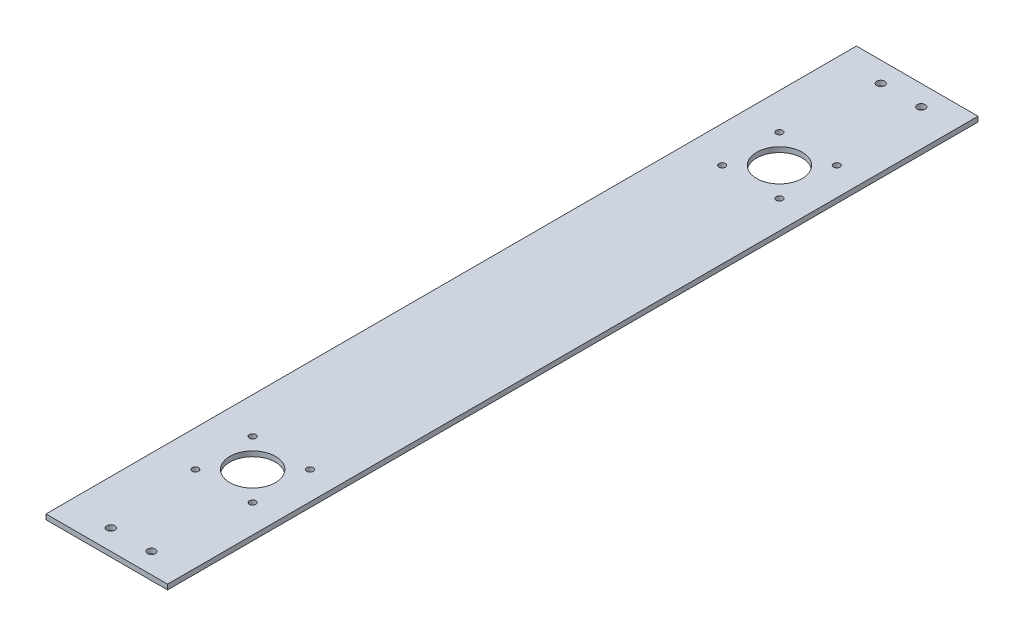
ISO-10303-21;
HEADER;
FILE_DESCRIPTION(('STEP AP214'),'2;1');
FILE_NAME('part.step','',(''),(''),'','','');
FILE_SCHEMA(('AUTOMOTIVE_DESIGN { 1 0 10303 214 1 1 1 1 }'));
ENDSEC;
DATA;
#1=APPLICATION_CONTEXT('core data for automotive mechanical design processes');
#2=APPLICATION_PROTOCOL_DEFINITION('international standard','automotive_design',2000,#1);
#3=PRODUCT_CONTEXT('',#1,'mechanical');
#4=PRODUCT('Part','Part','',(#3));
#5=PRODUCT_RELATED_PRODUCT_CATEGORY('part','',(#4));
#6=PRODUCT_DEFINITION_FORMATION('','',#4);
#7=PRODUCT_DEFINITION_CONTEXT('part definition',#1,'design');
#8=PRODUCT_DEFINITION('design','',#6,#7);
#9=PRODUCT_DEFINITION_SHAPE('','',#8);
#10=(LENGTH_UNIT() NAMED_UNIT(*) SI_UNIT(.MILLI.,.METRE.));
#11=(NAMED_UNIT(*) PLANE_ANGLE_UNIT() SI_UNIT($,.RADIAN.));
#12=(NAMED_UNIT(*) SI_UNIT($,.STERADIAN.) SOLID_ANGLE_UNIT());
#13=UNCERTAINTY_MEASURE_WITH_UNIT(LENGTH_MEASURE(1.E-05),#10,'distance_accuracy_value','');
#14=(GEOMETRIC_REPRESENTATION_CONTEXT(3) GLOBAL_UNCERTAINTY_ASSIGNED_CONTEXT((#13)) GLOBAL_UNIT_ASSIGNED_CONTEXT((#10,
#11,#12)) REPRESENTATION_CONTEXT('',''));
#15=CARTESIAN_POINT('',(0.,0.,0.));
#16=DIRECTION('',(0.,0.,1.));
#17=DIRECTION('',(1.,0.,0.));
#18=AXIS2_PLACEMENT_3D('',#15,#16,#17);
#19=CARTESIAN_POINT('',(0.,3.175,0.));
#20=DIRECTION('',(0.,0.,-1.));
#21=DIRECTION('',(-1.,0.,0.));
#22=AXIS2_PLACEMENT_3D('',#19,#20,#21);
#23=PLANE('',#22);
#24=DIRECTION('',(1.,0.,0.));
#25=VECTOR('',#24,1.);
#26=CARTESIAN_POINT('',(0.,3.175,0.));
#27=LINE('',#26,#25);
#28=CARTESIAN_POINT('',(124.46,3.175,0.));
#29=VERTEX_POINT('',#28);
#30=CARTESIAN_POINT('',(200.66,3.175,0.));
#31=VERTEX_POINT('',#30);
#32=EDGE_CURVE('E41',#29,#31,#27,.T.);
#33=ORIENTED_EDGE('',*,*,#32,.F.);
#34=DIRECTION('',(0.,1.,0.));
#35=VECTOR('',#34,1.);
#36=CARTESIAN_POINT('',(124.46,-0.00100000000000013,0.));
#37=LINE('',#36,#35);
#38=CARTESIAN_POINT('',(124.46,0.,0.));
#39=VERTEX_POINT('',#38);
#40=EDGE_CURVE('E73',#39,#29,#37,.T.);
#41=ORIENTED_EDGE('',*,*,#40,.F.);
#42=DIRECTION('',(1.,0.,0.));
#43=VECTOR('',#42,1.);
#44=CARTESIAN_POINT('',(0.,0.,0.));
#45=LINE('',#44,#43);
#46=CARTESIAN_POINT('',(200.66,0.,0.));
#47=VERTEX_POINT('',#46);
#48=EDGE_CURVE('E91',#39,#47,#45,.T.);
#49=ORIENTED_EDGE('',*,*,#48,.T.);
#50=DIRECTION('',(0.,1.,0.));
#51=VECTOR('',#50,1.);
#52=CARTESIAN_POINT('',(200.66,-0.00100000000000013,0.));
#53=LINE('',#52,#51);
#54=EDGE_CURVE('E49',#47,#31,#53,.T.);
#55=ORIENTED_EDGE('',*,*,#54,.T.);
#56=EDGE_LOOP('',(#33,#41,#49,#55));
#57=FACE_BOUND('',#56,.T.);
#58=ADVANCED_FACE('F33',(#57),#23,.F.);
#59=CARTESIAN_POINT('',(0.,3.175,-508.));
#60=DIRECTION('',(0.,0.,1.));
#61=DIRECTION('',(1.,0.,0.));
#62=AXIS2_PLACEMENT_3D('',#59,#60,#61);
#63=PLANE('',#62);
#64=DIRECTION('',(-1.,0.,0.));
#65=VECTOR('',#64,1.);
#66=CARTESIAN_POINT('',(0.,0.,-508.));
#67=LINE('',#66,#65);
#68=CARTESIAN_POINT('',(200.66,0.,-508.));
#69=VERTEX_POINT('',#68);
#70=CARTESIAN_POINT('',(124.46,0.,-508.));
#71=VERTEX_POINT('',#70);
#72=EDGE_CURVE('E36',#69,#71,#67,.T.);
#73=ORIENTED_EDGE('',*,*,#72,.T.);
#74=DIRECTION('',(0.,1.,0.));
#75=VECTOR('',#74,1.);
#76=CARTESIAN_POINT('',(124.46,-0.00100000000000013,-508.));
#77=LINE('',#76,#75);
#78=CARTESIAN_POINT('',(124.46,3.175,-508.));
#79=VERTEX_POINT('',#78);
#80=EDGE_CURVE('E57',#71,#79,#77,.T.);
#81=ORIENTED_EDGE('',*,*,#80,.T.);
#82=DIRECTION('',(-1.,0.,0.));
#83=VECTOR('',#82,1.);
#84=CARTESIAN_POINT('',(0.,3.175,-508.));
#85=LINE('',#84,#83);
#86=CARTESIAN_POINT('',(200.66,3.175,-508.));
#87=VERTEX_POINT('',#86);
#88=EDGE_CURVE('E11',#87,#79,#85,.T.);
#89=ORIENTED_EDGE('',*,*,#88,.F.);
#90=DIRECTION('',(0.,1.,0.));
#91=VECTOR('',#90,1.);
#92=CARTESIAN_POINT('',(200.66,-0.00100000000000013,-508.));
#93=LINE('',#92,#91);
#94=EDGE_CURVE('E179',#69,#87,#93,.T.);
#95=ORIENTED_EDGE('',*,*,#94,.F.);
#96=EDGE_LOOP('',(#73,#81,#89,#95));
#97=FACE_BOUND('',#96,.T.);
#98=ADVANCED_FACE('F193',(#97),#63,.F.);
#99=CARTESIAN_POINT('',(0.,3.175,0.));
#100=DIRECTION('',(0.,-1.,0.));
#101=DIRECTION('',(0.,0.,-1.));
#102=AXIS2_PLACEMENT_3D('',#99,#100,#101);
#103=PLANE('',#102);
#104=CARTESIAN_POINT('',(147.139487788,3.175,-401.139487788));
#105=DIRECTION('',(0.,-1.,0.));
#106=DIRECTION('',(0.,0.,-1.));
#107=AXIS2_PLACEMENT_3D('',#104,#105,#106);
#108=CIRCLE('',#107,2.0193);
#109=CARTESIAN_POINT('',(147.139487788,3.175,-403.158787788));
#110=VERTEX_POINT('',#109);
#111=EDGE_CURVE('E129',#110,#110,#108,.T.);
#112=ORIENTED_EDGE('',*,*,#111,.T.);
#113=EDGE_LOOP('',(#112));
#114=FACE_BOUND('',#113,.T.);
#115=CARTESIAN_POINT('',(147.139487788,3.175,-106.860512212));
#116=DIRECTION('',(0.,-1.,0.));
#117=DIRECTION('',(0.,0.,-1.));
#118=AXIS2_PLACEMENT_3D('',#115,#116,#117);
#119=CIRCLE('',#118,2.0193);
#120=CARTESIAN_POINT('',(147.139487788,3.175,-108.879812212));
#121=VERTEX_POINT('',#120);
#122=EDGE_CURVE('E134',#121,#121,#119,.T.);
#123=ORIENTED_EDGE('',*,*,#122,.T.);
#124=EDGE_LOOP('',(#123));
#125=FACE_BOUND('',#124,.T.);
#126=CARTESIAN_POINT('',(183.060512212,3.175,-106.860512212));
#127=DIRECTION('',(0.,-1.,0.));
#128=DIRECTION('',(0.,0.,-1.));
#129=AXIS2_PLACEMENT_3D('',#126,#127,#128);
#130=CIRCLE('',#129,2.0193);
#131=CARTESIAN_POINT('',(183.060512212,3.175,-108.879812212));
#132=VERTEX_POINT('',#131);
#133=EDGE_CURVE('E137',#132,#132,#130,.T.);
#134=ORIENTED_EDGE('',*,*,#133,.T.);
#135=EDGE_LOOP('',(#134));
#136=FACE_BOUND('',#135,.T.);
#137=CARTESIAN_POINT('',(183.060512212,3.175,-70.939487788));
#138=DIRECTION('',(0.,-1.,0.));
#139=DIRECTION('',(0.,0.,-1.));
#140=AXIS2_PLACEMENT_3D('',#137,#138,#139);
#141=CIRCLE('',#140,2.0193);
#142=CARTESIAN_POINT('',(183.060512212,3.175,-72.958787788));
#143=VERTEX_POINT('',#142);
#144=EDGE_CURVE('E140',#143,#143,#141,.T.);
#145=ORIENTED_EDGE('',*,*,#144,.T.);
#146=EDGE_LOOP('',(#145));
#147=FACE_BOUND('',#146,.T.);
#148=CARTESIAN_POINT('',(147.139487788,3.175,-70.939487788));
#149=DIRECTION('',(0.,-1.,0.));
#150=DIRECTION('',(0.,0.,-1.));
#151=AXIS2_PLACEMENT_3D('',#148,#149,#150);
#152=CIRCLE('',#151,2.0193);
#153=CARTESIAN_POINT('',(147.139487788,3.175,-72.958787788));
#154=VERTEX_POINT('',#153);
#155=EDGE_CURVE('E143',#154,#154,#152,.T.);
#156=ORIENTED_EDGE('',*,*,#155,.T.);
#157=EDGE_LOOP('',(#156));
#158=FACE_BOUND('',#157,.T.);
#159=CARTESIAN_POINT('',(147.139487788,3.175,-437.060512212));
#160=DIRECTION('',(0.,-1.,0.));
#161=DIRECTION('',(0.,0.,-1.));
#162=AXIS2_PLACEMENT_3D('',#159,#160,#161);
#163=CIRCLE('',#162,2.0193);
#164=CARTESIAN_POINT('',(147.139487788,3.175,-439.079812212));
#165=VERTEX_POINT('',#164);
#166=EDGE_CURVE('E146',#165,#165,#163,.T.);
#167=ORIENTED_EDGE('',*,*,#166,.T.);
#168=EDGE_LOOP('',(#167));
#169=FACE_BOUND('',#168,.T.);
#170=CARTESIAN_POINT('',(183.060512212,3.175,-437.060512212));
#171=DIRECTION('',(0.,-1.,0.));
#172=DIRECTION('',(0.,0.,-1.));
#173=AXIS2_PLACEMENT_3D('',#170,#171,#172);
#174=CIRCLE('',#173,2.0193);
#175=CARTESIAN_POINT('',(183.060512212,3.175,-439.079812212));
#176=VERTEX_POINT('',#175);
#177=EDGE_CURVE('E149',#176,#176,#174,.T.);
#178=ORIENTED_EDGE('',*,*,#177,.T.);
#179=EDGE_LOOP('',(#178));
#180=FACE_BOUND('',#179,.T.);
#181=CARTESIAN_POINT('',(183.060512212,3.175,-401.139487788));
#182=DIRECTION('',(0.,-1.,0.));
#183=DIRECTION('',(0.,0.,-1.));
#184=AXIS2_PLACEMENT_3D('',#181,#182,#183);
#185=CIRCLE('',#184,2.0193);
#186=CARTESIAN_POINT('',(183.060512212,3.175,-403.158787788));
#187=VERTEX_POINT('',#186);
#188=EDGE_CURVE('E152',#187,#187,#185,.T.);
#189=ORIENTED_EDGE('',*,*,#188,.T.);
#190=EDGE_LOOP('',(#189));
#191=FACE_BOUND('',#190,.T.);
#192=CARTESIAN_POINT('',(177.8,3.175,-12.7));
#193=DIRECTION('',(0.,-1.,0.));
#194=DIRECTION('',(0.,0.,-1.));
#195=AXIS2_PLACEMENT_3D('',#192,#193,#194);
#196=CIRCLE('',#195,2.4892);
#197=CARTESIAN_POINT('',(177.8,3.175,-15.1892));
#198=VERTEX_POINT('',#197);
#199=EDGE_CURVE('E105',#198,#198,#196,.T.);
#200=ORIENTED_EDGE('',*,*,#199,.T.);
#201=EDGE_LOOP('',(#200));
#202=FACE_BOUND('',#201,.T.);
#203=CARTESIAN_POINT('',(152.4,3.175,-12.7));
#204=DIRECTION('',(0.,-1.,0.));
#205=DIRECTION('',(0.,0.,-1.));
#206=AXIS2_PLACEMENT_3D('',#203,#204,#205);
#207=CIRCLE('',#206,2.4892);
#208=CARTESIAN_POINT('',(152.4,3.175,-15.1892));
#209=VERTEX_POINT('',#208);
#210=EDGE_CURVE('E110',#209,#209,#207,.T.);
#211=ORIENTED_EDGE('',*,*,#210,.T.);
#212=EDGE_LOOP('',(#211));
#213=FACE_BOUND('',#212,.T.);
#214=CARTESIAN_POINT('',(177.8,3.175,-495.3));
#215=DIRECTION('',(0.,-1.,0.));
#216=DIRECTION('',(0.,0.,-1.));
#217=AXIS2_PLACEMENT_3D('',#214,#215,#216);
#218=CIRCLE('',#217,2.48920000000001);
#219=CARTESIAN_POINT('',(177.8,3.175,-497.7892));
#220=VERTEX_POINT('',#219);
#221=EDGE_CURVE('E113',#220,#220,#218,.T.);
#222=ORIENTED_EDGE('',*,*,#221,.T.);
#223=EDGE_LOOP('',(#222));
#224=FACE_BOUND('',#223,.T.);
#225=CARTESIAN_POINT('',(152.4,3.175,-495.3));
#226=DIRECTION('',(0.,-1.,0.));
#227=DIRECTION('',(0.,0.,-1.));
#228=AXIS2_PLACEMENT_3D('',#225,#226,#227);
#229=CIRCLE('',#228,2.48920000000001);
#230=CARTESIAN_POINT('',(152.4,3.175,-497.7892));
#231=VERTEX_POINT('',#230);
#232=EDGE_CURVE('E116',#231,#231,#229,.T.);
#233=ORIENTED_EDGE('',*,*,#232,.T.);
#234=EDGE_LOOP('',(#233));
#235=FACE_BOUND('',#234,.T.);
#236=CARTESIAN_POINT('',(165.1,3.175,-419.1));
#237=DIRECTION('',(0.,1.,0.));
#238=DIRECTION('',(0.,0.,1.));
#239=AXIS2_PLACEMENT_3D('',#236,#237,#238);
#240=CIRCLE('',#239,14.2875);
#241=CARTESIAN_POINT('',(165.1,3.175,-404.8125));
#242=VERTEX_POINT('',#241);
#243=EDGE_CURVE('E93',#242,#242,#240,.T.);
#244=ORIENTED_EDGE('',*,*,#243,.F.);
#245=EDGE_LOOP('',(#244));
#246=FACE_BOUND('',#245,.T.);
#247=CARTESIAN_POINT('',(165.1,3.175,-88.9));
#248=DIRECTION('',(0.,1.,0.));
#249=DIRECTION('',(0.,0.,1.));
#250=AXIS2_PLACEMENT_3D('',#247,#248,#249);
#251=CIRCLE('',#250,14.2875);
#252=CARTESIAN_POINT('',(165.1,3.175,-74.6125));
#253=VERTEX_POINT('',#252);
#254=EDGE_CURVE('E102',#253,#253,#251,.T.);
#255=ORIENTED_EDGE('',*,*,#254,.F.);
#256=EDGE_LOOP('',(#255));
#257=FACE_BOUND('',#256,.T.);
#258=ORIENTED_EDGE('',*,*,#88,.T.);
#259=DIRECTION('',(0.,0.,-1.));
#260=VECTOR('',#259,1.);
#261=CARTESIAN_POINT('',(124.46,3.175,-508.));
#262=LINE('',#261,#260);
#263=EDGE_CURVE('E76',#29,#79,#262,.T.);
#264=ORIENTED_EDGE('',*,*,#263,.F.);
#265=ORIENTED_EDGE('',*,*,#32,.T.);
#266=DIRECTION('',(0.,0.,1.));
#267=VECTOR('',#266,1.);
#268=CARTESIAN_POINT('',(200.66,3.175,-508.));
#269=LINE('',#268,#267);
#270=EDGE_CURVE('E181',#87,#31,#269,.T.);
#271=ORIENTED_EDGE('',*,*,#270,.F.);
#272=EDGE_LOOP('',(#258,#264,#265,#271));
#273=FACE_BOUND('',#272,.T.);
#274=ADVANCED_FACE('F85',(#114,#125,#136,#147,#158,#169,#180,#191,#202,#213,#224,#235,#246,#257,
#273),#103,.F.);
#275=CARTESIAN_POINT('',(0.,0.,0.));
#276=DIRECTION('',(0.,-1.,0.));
#277=DIRECTION('',(0.,0.,-1.));
#278=AXIS2_PLACEMENT_3D('',#275,#276,#277);
#279=PLANE('',#278);
#280=DIRECTION('',(0.,0.,-1.));
#281=VECTOR('',#280,1.);
#282=CARTESIAN_POINT('',(124.46,0.,-508.));
#283=LINE('',#282,#281);
#284=EDGE_CURVE('E77',#39,#71,#283,.T.);
#285=ORIENTED_EDGE('',*,*,#284,.T.);
#286=ORIENTED_EDGE('',*,*,#72,.F.);
#287=DIRECTION('',(0.,0.,1.));
#288=VECTOR('',#287,1.);
#289=CARTESIAN_POINT('',(200.66,0.,-508.));
#290=LINE('',#289,#288);
#291=EDGE_CURVE('E184',#69,#47,#290,.T.);
#292=ORIENTED_EDGE('',*,*,#291,.T.);
#293=ORIENTED_EDGE('',*,*,#48,.F.);
#294=EDGE_LOOP('',(#285,#286,#292,#293));
#295=FACE_BOUND('',#294,.T.);
#296=CARTESIAN_POINT('',(147.139487788,0.,-401.139487788));
#297=DIRECTION('',(0.,1.,0.));
#298=DIRECTION('',(0.,0.,1.));
#299=AXIS2_PLACEMENT_3D('',#296,#297,#298);
#300=CIRCLE('',#299,2.0193);
#301=CARTESIAN_POINT('',(147.139487788,0.,-399.120187788));
#302=VERTEX_POINT('',#301);
#303=EDGE_CURVE('E160',#302,#302,#300,.T.);
#304=ORIENTED_EDGE('',*,*,#303,.T.);
#305=EDGE_LOOP('',(#304));
#306=FACE_BOUND('',#305,.T.);
#307=CARTESIAN_POINT('',(147.139487788,0.,-106.860512212));
#308=DIRECTION('',(0.,1.,0.));
#309=DIRECTION('',(0.,0.,-1.));
#310=AXIS2_PLACEMENT_3D('',#307,#308,#309);
#311=CIRCLE('',#310,2.0193);
#312=CARTESIAN_POINT('',(147.139487788,0.,-108.879812212));
#313=VERTEX_POINT('',#312);
#314=EDGE_CURVE('E172',#313,#313,#311,.T.);
#315=ORIENTED_EDGE('',*,*,#314,.T.);
#316=EDGE_LOOP('',(#315));
#317=FACE_BOUND('',#316,.T.);
#318=CARTESIAN_POINT('',(183.060512212,0.,-106.860512212));
#319=DIRECTION('',(0.,1.,0.));
#320=DIRECTION('',(0.,0.,-1.));
#321=AXIS2_PLACEMENT_3D('',#318,#319,#320);
#322=CIRCLE('',#321,2.0193);
#323=CARTESIAN_POINT('',(183.060512212,0.,-108.879812212));
#324=VERTEX_POINT('',#323);
#325=EDGE_CURVE('E168',#324,#324,#322,.T.);
#326=ORIENTED_EDGE('',*,*,#325,.T.);
#327=EDGE_LOOP('',(#326));
#328=FACE_BOUND('',#327,.T.);
#329=CARTESIAN_POINT('',(183.060512212,0.,-70.939487788));
#330=DIRECTION('',(0.,1.,0.));
#331=DIRECTION('',(0.,0.,-1.));
#332=AXIS2_PLACEMENT_3D('',#329,#330,#331);
#333=CIRCLE('',#332,2.0193);
#334=CARTESIAN_POINT('',(183.060512212,0.,-72.958787788));
#335=VERTEX_POINT('',#334);
#336=EDGE_CURVE('E165',#335,#335,#333,.T.);
#337=ORIENTED_EDGE('',*,*,#336,.T.);
#338=EDGE_LOOP('',(#337));
#339=FACE_BOUND('',#338,.T.);
#340=CARTESIAN_POINT('',(147.139487788,0.,-70.939487788));
#341=DIRECTION('',(0.,1.,0.));
#342=DIRECTION('',(0.,0.,-1.));
#343=AXIS2_PLACEMENT_3D('',#340,#341,#342);
#344=CIRCLE('',#343,2.0193);
#345=CARTESIAN_POINT('',(147.139487788,0.,-72.958787788));
#346=VERTEX_POINT('',#345);
#347=EDGE_CURVE('E169',#346,#346,#344,.T.);
#348=ORIENTED_EDGE('',*,*,#347,.T.);
#349=EDGE_LOOP('',(#348));
#350=FACE_BOUND('',#349,.T.);
#351=CARTESIAN_POINT('',(147.139487788,0.,-437.060512212));
#352=DIRECTION('',(0.,1.,0.));
#353=DIRECTION('',(0.,0.,1.));
#354=AXIS2_PLACEMENT_3D('',#351,#352,#353);
#355=CIRCLE('',#354,2.0193);
#356=CARTESIAN_POINT('',(147.139487788,0.,-435.041212212));
#357=VERTEX_POINT('',#356);
#358=EDGE_CURVE('E155',#357,#357,#355,.T.);
#359=ORIENTED_EDGE('',*,*,#358,.T.);
#360=EDGE_LOOP('',(#359));
#361=FACE_BOUND('',#360,.T.);
#362=CARTESIAN_POINT('',(183.060512212,0.,-437.060512212));
#363=DIRECTION('',(0.,1.,0.));
#364=DIRECTION('',(0.,0.,1.));
#365=AXIS2_PLACEMENT_3D('',#362,#363,#364);
#366=CIRCLE('',#365,2.0193);
#367=CARTESIAN_POINT('',(183.060512212,0.,-435.041212212));
#368=VERTEX_POINT('',#367);
#369=EDGE_CURVE('E159',#368,#368,#366,.T.);
#370=ORIENTED_EDGE('',*,*,#369,.T.);
#371=EDGE_LOOP('',(#370));
#372=FACE_BOUND('',#371,.T.);
#373=CARTESIAN_POINT('',(183.060512212,0.,-401.139487788));
#374=DIRECTION('',(0.,1.,0.));
#375=DIRECTION('',(0.,0.,1.));
#376=AXIS2_PLACEMENT_3D('',#373,#374,#375);
#377=CIRCLE('',#376,2.0193);
#378=CARTESIAN_POINT('',(183.060512212,0.,-399.120187788));
#379=VERTEX_POINT('',#378);
#380=EDGE_CURVE('E156',#379,#379,#377,.T.);
#381=ORIENTED_EDGE('',*,*,#380,.T.);
#382=EDGE_LOOP('',(#381));
#383=FACE_BOUND('',#382,.T.);
#384=CARTESIAN_POINT('',(177.8,0.,-12.7));
#385=DIRECTION('',(0.,1.,0.));
#386=DIRECTION('',(0.,0.,1.));
#387=AXIS2_PLACEMENT_3D('',#384,#385,#386);
#388=CIRCLE('',#387,2.4892);
#389=CARTESIAN_POINT('',(177.8,0.,-10.2108));
#390=VERTEX_POINT('',#389);
#391=EDGE_CURVE('E120',#390,#390,#388,.T.);
#392=ORIENTED_EDGE('',*,*,#391,.T.);
#393=EDGE_LOOP('',(#392));
#394=FACE_BOUND('',#393,.T.);
#395=CARTESIAN_POINT('',(152.4,0.,-12.7));
#396=DIRECTION('',(0.,1.,0.));
#397=DIRECTION('',(0.,0.,1.));
#398=AXIS2_PLACEMENT_3D('',#395,#396,#397);
#399=CIRCLE('',#398,2.4892);
#400=CARTESIAN_POINT('',(152.4,0.,-10.2108));
#401=VERTEX_POINT('',#400);
#402=EDGE_CURVE('E119',#401,#401,#399,.T.);
#403=ORIENTED_EDGE('',*,*,#402,.T.);
#404=EDGE_LOOP('',(#403));
#405=FACE_BOUND('',#404,.T.);
#406=CARTESIAN_POINT('',(177.8,0.,-495.3));
#407=DIRECTION('',(0.,1.,0.));
#408=DIRECTION('',(0.,0.,-1.));
#409=AXIS2_PLACEMENT_3D('',#406,#407,#408);
#410=CIRCLE('',#409,2.48920000000001);
#411=CARTESIAN_POINT('',(177.8,0.,-497.7892));
#412=VERTEX_POINT('',#411);
#413=EDGE_CURVE('E123',#412,#412,#410,.T.);
#414=ORIENTED_EDGE('',*,*,#413,.T.);
#415=EDGE_LOOP('',(#414));
#416=FACE_BOUND('',#415,.T.);
#417=CARTESIAN_POINT('',(152.4,0.,-495.3));
#418=DIRECTION('',(0.,1.,0.));
#419=DIRECTION('',(0.,0.,-1.));
#420=AXIS2_PLACEMENT_3D('',#417,#418,#419);
#421=CIRCLE('',#420,2.48920000000001);
#422=CARTESIAN_POINT('',(152.4,0.,-497.7892));
#423=VERTEX_POINT('',#422);
#424=EDGE_CURVE('E126',#423,#423,#421,.T.);
#425=ORIENTED_EDGE('',*,*,#424,.T.);
#426=EDGE_LOOP('',(#425));
#427=FACE_BOUND('',#426,.T.);
#428=CARTESIAN_POINT('',(165.1,0.,-419.1));
#429=DIRECTION('',(0.,1.,0.));
#430=DIRECTION('',(0.,0.,1.));
#431=AXIS2_PLACEMENT_3D('',#428,#429,#430);
#432=CIRCLE('',#431,14.2875);
#433=CARTESIAN_POINT('',(165.1,0.,-404.8125));
#434=VERTEX_POINT('',#433);
#435=EDGE_CURVE('E95',#434,#434,#432,.T.);
#436=ORIENTED_EDGE('',*,*,#435,.T.);
#437=EDGE_LOOP('',(#436));
#438=FACE_BOUND('',#437,.T.);
#439=CARTESIAN_POINT('',(165.1,0.,-88.9));
#440=DIRECTION('',(0.,1.,0.));
#441=DIRECTION('',(0.,0.,1.));
#442=AXIS2_PLACEMENT_3D('',#439,#440,#441);
#443=CIRCLE('',#442,14.2875);
#444=CARTESIAN_POINT('',(165.1,0.,-74.6125));
#445=VERTEX_POINT('',#444);
#446=EDGE_CURVE('E100',#445,#445,#443,.T.);
#447=ORIENTED_EDGE('',*,*,#446,.T.);
#448=EDGE_LOOP('',(#447));
#449=FACE_BOUND('',#448,.T.);
#450=ADVANCED_FACE('F189',(#295,#306,#317,#328,#339,#350,#361,#372,#383,#394,#405,#416,#427,
#438,#449),#279,.T.);
#451=CARTESIAN_POINT('',(165.1,0.,-88.9));
#452=DIRECTION('',(0.,1.,0.));
#453=DIRECTION('',(0.,0.,1.));
#454=AXIS2_PLACEMENT_3D('',#451,#452,#453);
#455=CYLINDRICAL_SURFACE('',#454,14.2875);
#456=ORIENTED_EDGE('',*,*,#446,.F.);
#457=EDGE_LOOP('',(#456));
#458=FACE_BOUND('',#457,.T.);
#459=ORIENTED_EDGE('',*,*,#254,.T.);
#460=EDGE_LOOP('',(#459));
#461=FACE_BOUND('',#460,.T.);
#462=ADVANCED_FACE('F219',(#458,#461),#455,.F.);
#463=CARTESIAN_POINT('',(165.1,0.,-419.1));
#464=DIRECTION('',(0.,1.,0.));
#465=DIRECTION('',(0.,0.,1.));
#466=AXIS2_PLACEMENT_3D('',#463,#464,#465);
#467=CYLINDRICAL_SURFACE('',#466,14.2875);
#468=ORIENTED_EDGE('',*,*,#435,.F.);
#469=EDGE_LOOP('',(#468));
#470=FACE_BOUND('',#469,.T.);
#471=ORIENTED_EDGE('',*,*,#243,.T.);
#472=EDGE_LOOP('',(#471));
#473=FACE_BOUND('',#472,.T.);
#474=ADVANCED_FACE('F221',(#470,#473),#467,.F.);
#475=CARTESIAN_POINT('',(152.4,0.,-495.3));
#476=DIRECTION('',(0.,1.,0.));
#477=DIRECTION('',(0.,0.,1.));
#478=AXIS2_PLACEMENT_3D('',#475,#476,#477);
#479=CYLINDRICAL_SURFACE('',#478,2.48920000000001);
#480=ORIENTED_EDGE('',*,*,#424,.F.);
#481=EDGE_LOOP('',(#480));
#482=FACE_BOUND('',#481,.T.);
#483=ORIENTED_EDGE('',*,*,#232,.F.);
#484=EDGE_LOOP('',(#483));
#485=FACE_BOUND('',#484,.T.);
#486=ADVANCED_FACE('F224',(#482,#485),#479,.F.);
#487=CARTESIAN_POINT('',(177.8,0.,-495.3));
#488=DIRECTION('',(0.,1.,0.));
#489=DIRECTION('',(0.,0.,1.));
#490=AXIS2_PLACEMENT_3D('',#487,#488,#489);
#491=CYLINDRICAL_SURFACE('',#490,2.48920000000001);
#492=ORIENTED_EDGE('',*,*,#413,.F.);
#493=EDGE_LOOP('',(#492));
#494=FACE_BOUND('',#493,.T.);
#495=ORIENTED_EDGE('',*,*,#221,.F.);
#496=EDGE_LOOP('',(#495));
#497=FACE_BOUND('',#496,.T.);
#498=ADVANCED_FACE('F237',(#494,#497),#491,.F.);
#499=CARTESIAN_POINT('',(152.4,0.,-12.7));
#500=DIRECTION('',(0.,1.,0.));
#501=DIRECTION('',(0.,0.,1.));
#502=AXIS2_PLACEMENT_3D('',#499,#500,#501);
#503=CYLINDRICAL_SURFACE('',#502,2.4892);
#504=ORIENTED_EDGE('',*,*,#402,.F.);
#505=EDGE_LOOP('',(#504));
#506=FACE_BOUND('',#505,.T.);
#507=ORIENTED_EDGE('',*,*,#210,.F.);
#508=EDGE_LOOP('',(#507));
#509=FACE_BOUND('',#508,.T.);
#510=ADVANCED_FACE('F233',(#506,#509),#503,.F.);
#511=CARTESIAN_POINT('',(177.8,0.,-12.7));
#512=DIRECTION('',(0.,1.,0.));
#513=DIRECTION('',(0.,0.,1.));
#514=AXIS2_PLACEMENT_3D('',#511,#512,#513);
#515=CYLINDRICAL_SURFACE('',#514,2.4892);
#516=ORIENTED_EDGE('',*,*,#391,.F.);
#517=EDGE_LOOP('',(#516));
#518=FACE_BOUND('',#517,.T.);
#519=ORIENTED_EDGE('',*,*,#199,.F.);
#520=EDGE_LOOP('',(#519));
#521=FACE_BOUND('',#520,.T.);
#522=ADVANCED_FACE('F229',(#518,#521),#515,.F.);
#523=CARTESIAN_POINT('',(183.060512212,0.,-401.139487788));
#524=DIRECTION('',(0.,1.,0.));
#525=DIRECTION('',(0.,0.,1.));
#526=AXIS2_PLACEMENT_3D('',#523,#524,#525);
#527=CYLINDRICAL_SURFACE('',#526,2.0193);
#528=ORIENTED_EDGE('',*,*,#380,.F.);
#529=EDGE_LOOP('',(#528));
#530=FACE_BOUND('',#529,.T.);
#531=ORIENTED_EDGE('',*,*,#188,.F.);
#532=EDGE_LOOP('',(#531));
#533=FACE_BOUND('',#532,.T.);
#534=ADVANCED_FACE('F232',(#530,#533),#527,.F.);
#535=CARTESIAN_POINT('',(183.060512212,0.,-437.060512212));
#536=DIRECTION('',(0.,1.,0.));
#537=DIRECTION('',(0.,0.,1.));
#538=AXIS2_PLACEMENT_3D('',#535,#536,#537);
#539=CYLINDRICAL_SURFACE('',#538,2.0193);
#540=ORIENTED_EDGE('',*,*,#369,.F.);
#541=EDGE_LOOP('',(#540));
#542=FACE_BOUND('',#541,.T.);
#543=ORIENTED_EDGE('',*,*,#177,.F.);
#544=EDGE_LOOP('',(#543));
#545=FACE_BOUND('',#544,.T.);
#546=ADVANCED_FACE('F247',(#542,#545),#539,.F.);
#547=CARTESIAN_POINT('',(147.139487788,0.,-437.060512212));
#548=DIRECTION('',(0.,1.,0.));
#549=DIRECTION('',(0.,0.,1.));
#550=AXIS2_PLACEMENT_3D('',#547,#548,#549);
#551=CYLINDRICAL_SURFACE('',#550,2.0193);
#552=ORIENTED_EDGE('',*,*,#358,.F.);
#553=EDGE_LOOP('',(#552));
#554=FACE_BOUND('',#553,.T.);
#555=ORIENTED_EDGE('',*,*,#166,.F.);
#556=EDGE_LOOP('',(#555));
#557=FACE_BOUND('',#556,.T.);
#558=ADVANCED_FACE('F251',(#554,#557),#551,.F.);
#559=CARTESIAN_POINT('',(147.139487788,0.,-70.939487788));
#560=DIRECTION('',(0.,1.,0.));
#561=DIRECTION('',(0.,0.,1.));
#562=AXIS2_PLACEMENT_3D('',#559,#560,#561);
#563=CYLINDRICAL_SURFACE('',#562,2.0193);
#564=ORIENTED_EDGE('',*,*,#347,.F.);
#565=EDGE_LOOP('',(#564));
#566=FACE_BOUND('',#565,.T.);
#567=ORIENTED_EDGE('',*,*,#155,.F.);
#568=EDGE_LOOP('',(#567));
#569=FACE_BOUND('',#568,.T.);
#570=ADVANCED_FACE('F255',(#566,#569),#563,.F.);
#571=CARTESIAN_POINT('',(183.060512212,0.,-70.939487788));
#572=DIRECTION('',(0.,1.,0.));
#573=DIRECTION('',(0.,0.,1.));
#574=AXIS2_PLACEMENT_3D('',#571,#572,#573);
#575=CYLINDRICAL_SURFACE('',#574,2.0193);
#576=ORIENTED_EDGE('',*,*,#336,.F.);
#577=EDGE_LOOP('',(#576));
#578=FACE_BOUND('',#577,.T.);
#579=ORIENTED_EDGE('',*,*,#144,.F.);
#580=EDGE_LOOP('',(#579));
#581=FACE_BOUND('',#580,.T.);
#582=ADVANCED_FACE('F257',(#578,#581),#575,.F.);
#583=CARTESIAN_POINT('',(183.060512212,0.,-106.860512212));
#584=DIRECTION('',(0.,1.,0.));
#585=DIRECTION('',(0.,0.,1.));
#586=AXIS2_PLACEMENT_3D('',#583,#584,#585);
#587=CYLINDRICAL_SURFACE('',#586,2.0193);
#588=ORIENTED_EDGE('',*,*,#325,.F.);
#589=EDGE_LOOP('',(#588));
#590=FACE_BOUND('',#589,.T.);
#591=ORIENTED_EDGE('',*,*,#133,.F.);
#592=EDGE_LOOP('',(#591));
#593=FACE_BOUND('',#592,.T.);
#594=ADVANCED_FACE('F260',(#590,#593),#587,.F.);
#595=CARTESIAN_POINT('',(147.139487788,0.,-106.860512212));
#596=DIRECTION('',(0.,1.,0.));
#597=DIRECTION('',(0.,0.,1.));
#598=AXIS2_PLACEMENT_3D('',#595,#596,#597);
#599=CYLINDRICAL_SURFACE('',#598,2.0193);
#600=ORIENTED_EDGE('',*,*,#314,.F.);
#601=EDGE_LOOP('',(#600));
#602=FACE_BOUND('',#601,.T.);
#603=ORIENTED_EDGE('',*,*,#122,.F.);
#604=EDGE_LOOP('',(#603));
#605=FACE_BOUND('',#604,.T.);
#606=ADVANCED_FACE('F203',(#602,#605),#599,.F.);
#607=CARTESIAN_POINT('',(147.139487788,0.,-401.139487788));
#608=DIRECTION('',(0.,1.,0.));
#609=DIRECTION('',(0.,0.,1.));
#610=AXIS2_PLACEMENT_3D('',#607,#608,#609);
#611=CYLINDRICAL_SURFACE('',#610,2.0193);
#612=ORIENTED_EDGE('',*,*,#303,.F.);
#613=EDGE_LOOP('',(#612));
#614=FACE_BOUND('',#613,.T.);
#615=ORIENTED_EDGE('',*,*,#111,.F.);
#616=EDGE_LOOP('',(#615));
#617=FACE_BOUND('',#616,.T.);
#618=ADVANCED_FACE('F196',(#614,#617),#611,.F.);
#619=CARTESIAN_POINT('',(200.66,-0.00100000000000013,-508.));
#620=DIRECTION('',(-1.,0.,0.));
#621=DIRECTION('',(0.,0.,1.));
#622=AXIS2_PLACEMENT_3D('',#619,#620,#621);
#623=PLANE('',#622);
#624=ORIENTED_EDGE('',*,*,#94,.T.);
#625=ORIENTED_EDGE('',*,*,#270,.T.);
#626=ORIENTED_EDGE('',*,*,#54,.F.);
#627=ORIENTED_EDGE('',*,*,#291,.F.);
#628=EDGE_LOOP('',(#624,#625,#626,#627));
#629=FACE_BOUND('',#628,.T.);
#630=ADVANCED_FACE('F194',(#629),#623,.F.);
#631=CARTESIAN_POINT('',(124.46,-0.00100000000000013,-508.));
#632=DIRECTION('',(1.,0.,0.));
#633=DIRECTION('',(0.,0.,-1.));
#634=AXIS2_PLACEMENT_3D('',#631,#632,#633);
#635=PLANE('',#634);
#636=ORIENTED_EDGE('',*,*,#40,.T.);
#637=ORIENTED_EDGE('',*,*,#263,.T.);
#638=ORIENTED_EDGE('',*,*,#80,.F.);
#639=ORIENTED_EDGE('',*,*,#284,.F.);
#640=EDGE_LOOP('',(#636,#637,#638,#639));
#641=FACE_BOUND('',#640,.T.);
#642=ADVANCED_FACE('F75',(#641),#635,.F.);
#643=CLOSED_SHELL('',(#58,#98,#274,#450,#462,#474,#486,#498,#510,#522,#534,#546,#558,#570,#582,
#594,#606,#618,#630,#642));
#644=MANIFOLD_SOLID_BREP('B2',#643);
#645=ADVANCED_BREP_SHAPE_REPRESENTATION('',(#18,#644),#14);
#646=SHAPE_DEFINITION_REPRESENTATION(#9,#645);
ENDSEC;
END-ISO-10303-21;
